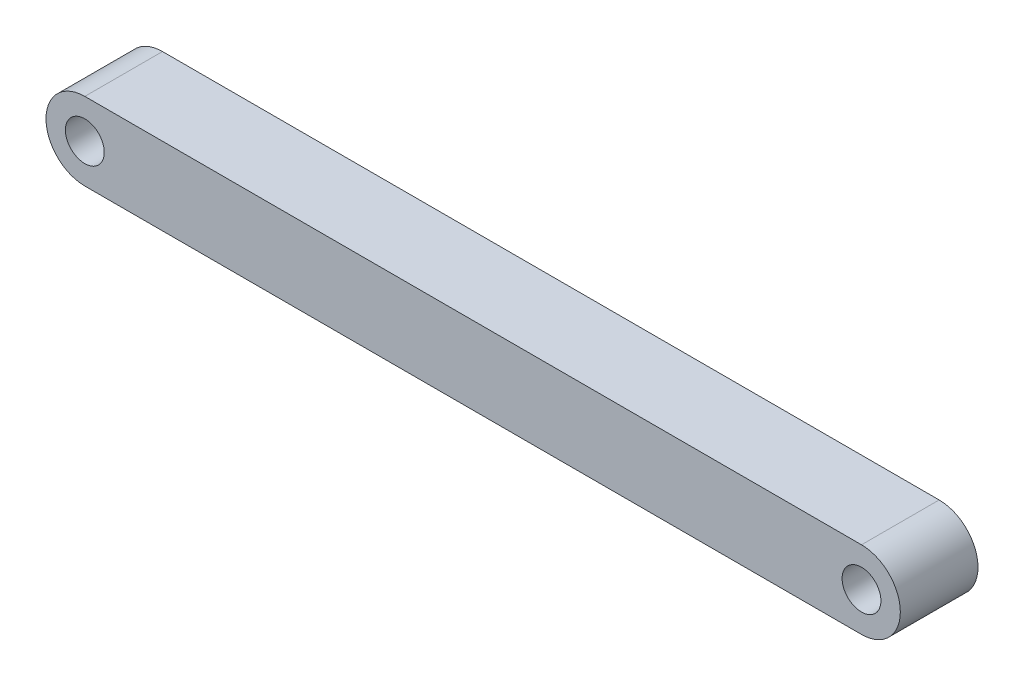
ISO-10303-21;
HEADER;
FILE_DESCRIPTION(('STEP AP214'),'2;1');
FILE_NAME('part.step','',(''),(''),'','','');
FILE_SCHEMA(('AUTOMOTIVE_DESIGN { 1 0 10303 214 1 1 1 1 }'));
ENDSEC;
DATA;
#1=APPLICATION_CONTEXT('core data for automotive mechanical design processes');
#2=APPLICATION_PROTOCOL_DEFINITION('international standard','automotive_design',2000,#1);
#3=PRODUCT_CONTEXT('',#1,'mechanical');
#4=PRODUCT('Part','Part','',(#3));
#5=PRODUCT_RELATED_PRODUCT_CATEGORY('part','',(#4));
#6=PRODUCT_DEFINITION_FORMATION('','',#4);
#7=PRODUCT_DEFINITION_CONTEXT('part definition',#1,'design');
#8=PRODUCT_DEFINITION('design','',#6,#7);
#9=PRODUCT_DEFINITION_SHAPE('','',#8);
#10=(LENGTH_UNIT() NAMED_UNIT(*) SI_UNIT(.MILLI.,.METRE.));
#11=(NAMED_UNIT(*) PLANE_ANGLE_UNIT() SI_UNIT($,.RADIAN.));
#12=(NAMED_UNIT(*) SI_UNIT($,.STERADIAN.) SOLID_ANGLE_UNIT());
#13=UNCERTAINTY_MEASURE_WITH_UNIT(LENGTH_MEASURE(1.E-05),#10,'distance_accuracy_value','');
#14=(GEOMETRIC_REPRESENTATION_CONTEXT(3) GLOBAL_UNCERTAINTY_ASSIGNED_CONTEXT((#13)) GLOBAL_UNIT_ASSIGNED_CONTEXT((#10,
#11,#12)) REPRESENTATION_CONTEXT('',''));
#15=CARTESIAN_POINT('',(0.,0.,0.));
#16=DIRECTION('',(0.,0.,1.));
#17=DIRECTION('',(1.,0.,0.));
#18=AXIS2_PLACEMENT_3D('',#15,#16,#17);
#19=CARTESIAN_POINT('',(-50.,0.,10.));
#20=DIRECTION('',(0.,0.,1.));
#21=DIRECTION('',(1.,0.,0.));
#22=AXIS2_PLACEMENT_3D('',#19,#20,#21);
#23=PLANE('',#22);
#24=CARTESIAN_POINT('',(-50.,0.,10.));
#25=DIRECTION('',(0.,0.,1.));
#26=DIRECTION('',(1.,0.,0.));
#27=AXIS2_PLACEMENT_3D('',#24,#25,#26);
#28=CIRCLE('',#27,2.5);
#29=CARTESIAN_POINT('',(-47.5,0.,10.));
#30=VERTEX_POINT('',#29);
#31=EDGE_CURVE('E115',#30,#30,#28,.T.);
#32=ORIENTED_EDGE('',*,*,#31,.F.);
#33=EDGE_LOOP('',(#32));
#34=FACE_BOUND('',#33,.T.);
#35=CARTESIAN_POINT('',(-50.,0.,10.));
#36=DIRECTION('',(0.,0.,1.));
#37=DIRECTION('',(1.,0.,0.));
#38=AXIS2_PLACEMENT_3D('',#35,#36,#37);
#39=CIRCLE('',#38,5.);
#40=CARTESIAN_POINT('',(-50.,5.,10.));
#41=VERTEX_POINT('',#40);
#42=CARTESIAN_POINT('',(-50.,-5.,10.));
#43=VERTEX_POINT('',#42);
#44=EDGE_CURVE('E95',#41,#43,#39,.T.);
#45=ORIENTED_EDGE('',*,*,#44,.T.);
#46=DIRECTION('',(1.,0.,0.));
#47=VECTOR('',#46,1.);
#48=CARTESIAN_POINT('',(-50.,-5.,10.));
#49=LINE('',#48,#47);
#50=CARTESIAN_POINT('',(50.,-5.00000000000001,10.));
#51=VERTEX_POINT('',#50);
#52=EDGE_CURVE('E90',#43,#51,#49,.T.);
#53=ORIENTED_EDGE('',*,*,#52,.T.);
#54=CARTESIAN_POINT('',(50.,0.,10.));
#55=DIRECTION('',(0.,0.,1.));
#56=DIRECTION('',(1.,0.,0.));
#57=AXIS2_PLACEMENT_3D('',#54,#55,#56);
#58=CIRCLE('',#57,5.);
#59=CARTESIAN_POINT('',(50.,4.99999999999998,10.));
#60=VERTEX_POINT('',#59);
#61=EDGE_CURVE('E93',#51,#60,#58,.T.);
#62=ORIENTED_EDGE('',*,*,#61,.T.);
#63=DIRECTION('',(-1.,0.,0.));
#64=VECTOR('',#63,1.);
#65=CARTESIAN_POINT('',(-50.,5.,10.));
#66=LINE('',#65,#64);
#67=EDGE_CURVE('E60',#60,#41,#66,.T.);
#68=ORIENTED_EDGE('',*,*,#67,.T.);
#69=EDGE_LOOP('',(#45,#53,#62,#68));
#70=FACE_BOUND('',#69,.T.);
#71=CARTESIAN_POINT('',(50.,0.,10.));
#72=DIRECTION('',(0.,0.,1.));
#73=DIRECTION('',(1.,0.,0.));
#74=AXIS2_PLACEMENT_3D('',#71,#72,#73);
#75=CIRCLE('',#74,2.50000000000001);
#76=CARTESIAN_POINT('',(52.5,0.,10.));
#77=VERTEX_POINT('',#76);
#78=EDGE_CURVE('E137',#77,#77,#75,.T.);
#79=ORIENTED_EDGE('',*,*,#78,.F.);
#80=EDGE_LOOP('',(#79));
#81=FACE_BOUND('',#80,.T.);
#82=ADVANCED_FACE('F42',(#34,#70,#81),#23,.T.);
#83=CARTESIAN_POINT('',(-50.,0.,0.));
#84=DIRECTION('',(0.,0.,1.));
#85=DIRECTION('',(1.,0.,0.));
#86=AXIS2_PLACEMENT_3D('',#83,#84,#85);
#87=PLANE('',#86);
#88=CARTESIAN_POINT('',(-50.,0.,0.));
#89=DIRECTION('',(0.,0.,1.));
#90=DIRECTION('',(1.,0.,0.));
#91=AXIS2_PLACEMENT_3D('',#88,#89,#90);
#92=CIRCLE('',#91,5.);
#93=CARTESIAN_POINT('',(-50.,5.,0.));
#94=VERTEX_POINT('',#93);
#95=CARTESIAN_POINT('',(-50.,-5.,0.));
#96=VERTEX_POINT('',#95);
#97=EDGE_CURVE('E111',#94,#96,#92,.T.);
#98=ORIENTED_EDGE('',*,*,#97,.F.);
#99=DIRECTION('',(-1.,0.,0.));
#100=VECTOR('',#99,1.);
#101=CARTESIAN_POINT('',(-50.,5.,0.));
#102=LINE('',#101,#100);
#103=CARTESIAN_POINT('',(50.,4.99999999999998,0.));
#104=VERTEX_POINT('',#103);
#105=EDGE_CURVE('E83',#104,#94,#102,.T.);
#106=ORIENTED_EDGE('',*,*,#105,.F.);
#107=CARTESIAN_POINT('',(50.,0.,0.));
#108=DIRECTION('',(0.,0.,1.));
#109=DIRECTION('',(1.,0.,0.));
#110=AXIS2_PLACEMENT_3D('',#107,#108,#109);
#111=CIRCLE('',#110,5.);
#112=CARTESIAN_POINT('',(50.,-5.00000000000001,0.));
#113=VERTEX_POINT('',#112);
#114=EDGE_CURVE('E77',#113,#104,#111,.T.);
#115=ORIENTED_EDGE('',*,*,#114,.F.);
#116=DIRECTION('',(1.,0.,0.));
#117=VECTOR('',#116,1.);
#118=CARTESIAN_POINT('',(-50.,-5.,0.));
#119=LINE('',#118,#117);
#120=EDGE_CURVE('E100',#96,#113,#119,.T.);
#121=ORIENTED_EDGE('',*,*,#120,.F.);
#122=EDGE_LOOP('',(#98,#106,#115,#121));
#123=FACE_BOUND('',#122,.T.);
#124=CARTESIAN_POINT('',(-50.,0.,0.));
#125=DIRECTION('',(0.,0.,1.));
#126=DIRECTION('',(1.,0.,0.));
#127=AXIS2_PLACEMENT_3D('',#124,#125,#126);
#128=CIRCLE('',#127,2.5);
#129=CARTESIAN_POINT('',(-47.5,0.,0.));
#130=VERTEX_POINT('',#129);
#131=EDGE_CURVE('E133',#130,#130,#128,.T.);
#132=ORIENTED_EDGE('',*,*,#131,.T.);
#133=EDGE_LOOP('',(#132));
#134=FACE_BOUND('',#133,.T.);
#135=CARTESIAN_POINT('',(50.,0.,0.));
#136=DIRECTION('',(0.,0.,1.));
#137=DIRECTION('',(1.,0.,0.));
#138=AXIS2_PLACEMENT_3D('',#135,#136,#137);
#139=CIRCLE('',#138,2.50000000000001);
#140=CARTESIAN_POINT('',(52.5,0.,0.));
#141=VERTEX_POINT('',#140);
#142=EDGE_CURVE('E141',#141,#141,#139,.T.);
#143=ORIENTED_EDGE('',*,*,#142,.T.);
#144=EDGE_LOOP('',(#143));
#145=FACE_BOUND('',#144,.T.);
#146=ADVANCED_FACE('F128',(#123,#134,#145),#87,.F.);
#147=CARTESIAN_POINT('',(-50.,0.,10.));
#148=DIRECTION('',(0.,0.,-1.));
#149=DIRECTION('',(-1.,0.,0.));
#150=AXIS2_PLACEMENT_3D('',#147,#148,#149);
#151=CYLINDRICAL_SURFACE('',#150,5.);
#152=ORIENTED_EDGE('',*,*,#97,.T.);
#153=DIRECTION('',(0.,0.,-1.));
#154=VECTOR('',#153,1.);
#155=CARTESIAN_POINT('',(-50.,-5.,10.));
#156=LINE('',#155,#154);
#157=EDGE_CURVE('E11',#43,#96,#156,.T.);
#158=ORIENTED_EDGE('',*,*,#157,.F.);
#159=ORIENTED_EDGE('',*,*,#44,.F.);
#160=DIRECTION('',(0.,0.,-1.));
#161=VECTOR('',#160,1.);
#162=CARTESIAN_POINT('',(-50.,5.,10.));
#163=LINE('',#162,#161);
#164=EDGE_CURVE('E107',#41,#94,#163,.T.);
#165=ORIENTED_EDGE('',*,*,#164,.T.);
#166=EDGE_LOOP('',(#152,#158,#159,#165));
#167=FACE_BOUND('',#166,.T.);
#168=ADVANCED_FACE('F44',(#167),#151,.T.);
#169=CARTESIAN_POINT('',(-50.,-5.,10.));
#170=DIRECTION('',(0.,1.,0.));
#171=DIRECTION('',(-1.,0.,0.));
#172=AXIS2_PLACEMENT_3D('',#169,#170,#171);
#173=PLANE('',#172);
#174=ORIENTED_EDGE('',*,*,#120,.T.);
#175=DIRECTION('',(0.,0.,-1.));
#176=VECTOR('',#175,1.);
#177=CARTESIAN_POINT('',(50.,-5.00000000000001,10.));
#178=LINE('',#177,#176);
#179=EDGE_CURVE('E52',#51,#113,#178,.T.);
#180=ORIENTED_EDGE('',*,*,#179,.F.);
#181=ORIENTED_EDGE('',*,*,#52,.F.);
#182=ORIENTED_EDGE('',*,*,#157,.T.);
#183=EDGE_LOOP('',(#174,#180,#181,#182));
#184=FACE_BOUND('',#183,.T.);
#185=ADVANCED_FACE('F99',(#184),#173,.F.);
#186=CARTESIAN_POINT('',(50.,0.,10.));
#187=DIRECTION('',(0.,0.,-1.));
#188=DIRECTION('',(-1.,0.,0.));
#189=AXIS2_PLACEMENT_3D('',#186,#187,#188);
#190=CYLINDRICAL_SURFACE('',#189,5.);
#191=ORIENTED_EDGE('',*,*,#114,.T.);
#192=DIRECTION('',(0.,0.,-1.));
#193=VECTOR('',#192,1.);
#194=CARTESIAN_POINT('',(50.,4.99999999999998,10.));
#195=LINE('',#194,#193);
#196=EDGE_CURVE('E102',#60,#104,#195,.T.);
#197=ORIENTED_EDGE('',*,*,#196,.F.);
#198=ORIENTED_EDGE('',*,*,#61,.F.);
#199=ORIENTED_EDGE('',*,*,#179,.T.);
#200=EDGE_LOOP('',(#191,#197,#198,#199));
#201=FACE_BOUND('',#200,.T.);
#202=ADVANCED_FACE('F103',(#201),#190,.T.);
#203=CARTESIAN_POINT('',(-50.,5.,10.));
#204=DIRECTION('',(0.,-1.,0.));
#205=DIRECTION('',(1.,0.,0.));
#206=AXIS2_PLACEMENT_3D('',#203,#204,#205);
#207=PLANE('',#206);
#208=ORIENTED_EDGE('',*,*,#105,.T.);
#209=ORIENTED_EDGE('',*,*,#164,.F.);
#210=ORIENTED_EDGE('',*,*,#67,.F.);
#211=ORIENTED_EDGE('',*,*,#196,.T.);
#212=EDGE_LOOP('',(#208,#209,#210,#211));
#213=FACE_BOUND('',#212,.T.);
#214=ADVANCED_FACE('F125',(#213),#207,.F.);
#215=CARTESIAN_POINT('',(-50.,0.,10.));
#216=DIRECTION('',(0.,0.,-1.));
#217=DIRECTION('',(-1.,0.,0.));
#218=AXIS2_PLACEMENT_3D('',#215,#216,#217);
#219=CYLINDRICAL_SURFACE('',#218,2.5);
#220=ORIENTED_EDGE('',*,*,#31,.T.);
#221=EDGE_LOOP('',(#220));
#222=FACE_BOUND('',#221,.T.);
#223=ORIENTED_EDGE('',*,*,#131,.F.);
#224=EDGE_LOOP('',(#223));
#225=FACE_BOUND('',#224,.T.);
#226=ADVANCED_FACE('F160',(#222,#225),#219,.F.);
#227=CARTESIAN_POINT('',(50.,0.,10.));
#228=DIRECTION('',(0.,0.,-1.));
#229=DIRECTION('',(-1.,0.,0.));
#230=AXIS2_PLACEMENT_3D('',#227,#228,#229);
#231=CYLINDRICAL_SURFACE('',#230,2.50000000000001);
#232=ORIENTED_EDGE('',*,*,#78,.T.);
#233=EDGE_LOOP('',(#232));
#234=FACE_BOUND('',#233,.T.);
#235=ORIENTED_EDGE('',*,*,#142,.F.);
#236=EDGE_LOOP('',(#235));
#237=FACE_BOUND('',#236,.T.);
#238=ADVANCED_FACE('F149',(#234,#237),#231,.F.);
#239=CLOSED_SHELL('',(#82,#146,#168,#185,#202,#214,#226,#238));
#240=MANIFOLD_SOLID_BREP('B2',#239);
#241=ADVANCED_BREP_SHAPE_REPRESENTATION('',(#18,#240),#14);
#242=SHAPE_DEFINITION_REPRESENTATION(#9,#241);
ENDSEC;
END-ISO-10303-21;
